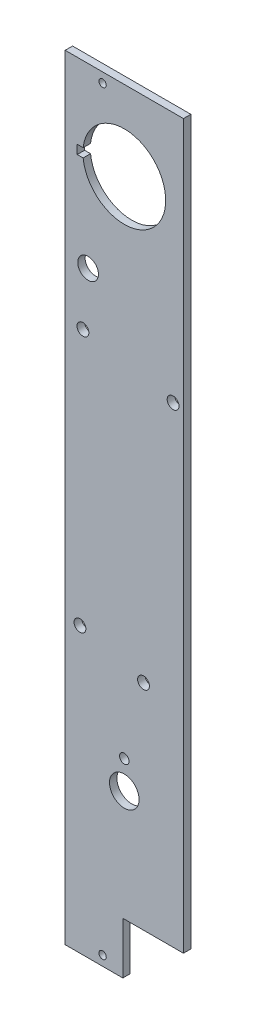
ISO-10303-21;
HEADER;
FILE_DESCRIPTION(('STEP AP214'),'2;1');
FILE_NAME('part.step','',(''),(''),'','','');
FILE_SCHEMA(('AUTOMOTIVE_DESIGN { 1 0 10303 214 1 1 1 1 }'));
ENDSEC;
DATA;
#1=APPLICATION_CONTEXT('core data for automotive mechanical design processes');
#2=APPLICATION_PROTOCOL_DEFINITION('international standard','automotive_design',2000,#1);
#3=PRODUCT_CONTEXT('',#1,'mechanical');
#4=PRODUCT('Part','Part','',(#3));
#5=PRODUCT_RELATED_PRODUCT_CATEGORY('part','',(#4));
#6=PRODUCT_DEFINITION_FORMATION('','',#4);
#7=PRODUCT_DEFINITION_CONTEXT('part definition',#1,'design');
#8=PRODUCT_DEFINITION('design','',#6,#7);
#9=PRODUCT_DEFINITION_SHAPE('','',#8);
#10=(LENGTH_UNIT() NAMED_UNIT(*) SI_UNIT(.MILLI.,.METRE.));
#11=(NAMED_UNIT(*) PLANE_ANGLE_UNIT() SI_UNIT($,.RADIAN.));
#12=(NAMED_UNIT(*) SI_UNIT($,.STERADIAN.) SOLID_ANGLE_UNIT());
#13=UNCERTAINTY_MEASURE_WITH_UNIT(LENGTH_MEASURE(1.E-05),#10,'distance_accuracy_value','');
#14=(GEOMETRIC_REPRESENTATION_CONTEXT(3) GLOBAL_UNCERTAINTY_ASSIGNED_CONTEXT((#13)) GLOBAL_UNIT_ASSIGNED_CONTEXT((#10,
#11,#12)) REPRESENTATION_CONTEXT('',''));
#15=CARTESIAN_POINT('',(0.,0.,0.));
#16=DIRECTION('',(0.,0.,1.));
#17=DIRECTION('',(1.,0.,0.));
#18=AXIS2_PLACEMENT_3D('',#15,#16,#17);
#19=CARTESIAN_POINT('',(0.,0.,2.5));
#20=DIRECTION('',(0.,0.,-1.));
#21=DIRECTION('',(-1.,0.,0.));
#22=AXIS2_PLACEMENT_3D('',#19,#20,#21);
#23=PLANE('',#22);
#24=CARTESIAN_POINT('',(7.75,202.,2.5));
#25=DIRECTION('',(0.,0.,1.));
#26=DIRECTION('',(1.,0.,0.));
#27=AXIS2_PLACEMENT_3D('',#24,#25,#26);
#28=CIRCLE('',#27,3.5);
#29=CARTESIAN_POINT('',(11.25,202.,2.5));
#30=VERTEX_POINT('',#29);
#31=EDGE_CURVE('E135',#30,#30,#28,.T.);
#32=ORIENTED_EDGE('',*,*,#31,.F.);
#33=EDGE_LOOP('',(#32));
#34=FACE_BOUND('',#33,.T.);
#35=CARTESIAN_POINT('',(6.,183.25,2.5));
#36=DIRECTION('',(0.,0.,1.));
#37=DIRECTION('',(1.,0.,0.));
#38=AXIS2_PLACEMENT_3D('',#35,#36,#37);
#39=CIRCLE('',#38,2.);
#40=CARTESIAN_POINT('',(8.,183.25,2.5));
#41=VERTEX_POINT('',#40);
#42=EDGE_CURVE('E141',#41,#41,#39,.T.);
#43=ORIENTED_EDGE('',*,*,#42,.F.);
#44=EDGE_LOOP('',(#43));
#45=FACE_BOUND('',#44,.T.);
#46=CARTESIAN_POINT('',(36.5,177.,2.5));
#47=DIRECTION('',(0.,0.,1.));
#48=DIRECTION('',(1.,0.,0.));
#49=AXIS2_PLACEMENT_3D('',#46,#47,#48);
#50=CIRCLE('',#49,2.);
#51=CARTESIAN_POINT('',(38.5,177.,2.5));
#52=VERTEX_POINT('',#51);
#53=EDGE_CURVE('E147',#52,#52,#50,.T.);
#54=ORIENTED_EDGE('',*,*,#53,.F.);
#55=EDGE_LOOP('',(#54));
#56=FACE_BOUND('',#55,.T.);
#57=CARTESIAN_POINT('',(26.5,90.,2.5));
#58=DIRECTION('',(0.,0.,1.));
#59=DIRECTION('',(1.,0.,0.));
#60=AXIS2_PLACEMENT_3D('',#57,#58,#59);
#61=CIRCLE('',#60,2.00000000000001);
#62=CARTESIAN_POINT('',(28.5,90.,2.5));
#63=VERTEX_POINT('',#62);
#64=EDGE_CURVE('E153',#63,#63,#61,.T.);
#65=ORIENTED_EDGE('',*,*,#64,.F.);
#66=EDGE_LOOP('',(#65));
#67=FACE_BOUND('',#66,.T.);
#68=CARTESIAN_POINT('',(5.,96.,2.5));
#69=DIRECTION('',(0.,0.,1.));
#70=DIRECTION('',(1.,0.,0.));
#71=AXIS2_PLACEMENT_3D('',#68,#69,#70);
#72=CIRCLE('',#71,2.);
#73=CARTESIAN_POINT('',(7.,96.,2.5));
#74=VERTEX_POINT('',#73);
#75=EDGE_CURVE('E159',#74,#74,#72,.T.);
#76=ORIENTED_EDGE('',*,*,#75,.F.);
#77=EDGE_LOOP('',(#76));
#78=FACE_BOUND('',#77,.T.);
#79=CARTESIAN_POINT('',(20.,64.5047736751736,2.5));
#80=DIRECTION('',(0.,0.,1.));
#81=DIRECTION('',(1.,0.,0.));
#82=AXIS2_PLACEMENT_3D('',#79,#80,#81);
#83=CIRCLE('',#82,1.6);
#84=CARTESIAN_POINT('',(21.6,64.5047736751736,2.5));
#85=VERTEX_POINT('',#84);
#86=EDGE_CURVE('E165',#85,#85,#83,.T.);
#87=ORIENTED_EDGE('',*,*,#86,.F.);
#88=EDGE_LOOP('',(#87));
#89=FACE_BOUND('',#88,.T.);
#90=DIRECTION('',(-1.,0.,0.));
#91=VECTOR('',#90,1.);
#92=CARTESIAN_POINT('',(4.08058908868214,236.497785389585,2.5));
#93=LINE('',#92,#91);
#94=CARTESIAN_POINT('',(6.08058909292492,236.497785389585,2.5));
#95=VERTEX_POINT('',#94);
#96=CARTESIAN_POINT('',(4.08058908868214,236.497785389585,2.5));
#97=VERTEX_POINT('',#96);
#98=EDGE_CURVE('E188',#95,#97,#93,.T.);
#99=ORIENTED_EDGE('',*,*,#98,.F.);
#100=CARTESIAN_POINT('',(20.,234.997785389585,2.5));
#101=DIRECTION('',(0.,0.,1.));
#102=DIRECTION('',(1.,0.,0.));
#103=AXIS2_PLACEMENT_3D('',#100,#101,#102);
#104=CIRCLE('',#103,14.);
#105=CARTESIAN_POINT('',(6.08058909292494,233.497785389585,2.5));
#106=VERTEX_POINT('',#105);
#107=EDGE_CURVE('E56',#106,#95,#104,.T.);
#108=ORIENTED_EDGE('',*,*,#107,.F.);
#109=DIRECTION('',(1.,0.,0.));
#110=VECTOR('',#109,1.);
#111=CARTESIAN_POINT('',(6.08058909292494,233.497785389585,2.5));
#112=LINE('',#111,#110);
#113=CARTESIAN_POINT('',(4.08058908868214,233.497785389585,2.5));
#114=VERTEX_POINT('',#113);
#115=EDGE_CURVE('E177',#114,#106,#112,.T.);
#116=ORIENTED_EDGE('',*,*,#115,.F.);
#117=DIRECTION('',(0.,-1.,0.));
#118=VECTOR('',#117,1.);
#119=CARTESIAN_POINT('',(4.08058908868214,233.497785389585,2.5));
#120=LINE('',#119,#118);
#121=EDGE_CURVE('E191',#97,#114,#120,.T.);
#122=ORIENTED_EDGE('',*,*,#121,.F.);
#123=EDGE_LOOP('',(#99,#108,#116,#122));
#124=FACE_BOUND('',#123,.T.);
#125=CARTESIAN_POINT('',(20.,55.0047736751736,2.5));
#126=DIRECTION('',(0.,0.,1.));
#127=DIRECTION('',(1.,0.,0.));
#128=AXIS2_PLACEMENT_3D('',#125,#126,#127);
#129=CIRCLE('',#128,5.);
#130=CARTESIAN_POINT('',(25.,55.0047736751736,2.5));
#131=VERTEX_POINT('',#130);
#132=EDGE_CURVE('E198',#131,#131,#129,.T.);
#133=ORIENTED_EDGE('',*,*,#132,.F.);
#134=EDGE_LOOP('',(#133));
#135=FACE_BOUND('',#134,.T.);
#136=CARTESIAN_POINT('',(12.65,258.7,2.5));
#137=DIRECTION('',(0.,0.,1.));
#138=DIRECTION('',(1.,0.,0.));
#139=AXIS2_PLACEMENT_3D('',#136,#137,#138);
#140=CIRCLE('',#139,1.25);
#141=CARTESIAN_POINT('',(13.9,258.7,2.5));
#142=VERTEX_POINT('',#141);
#143=EDGE_CURVE('E216',#142,#142,#140,.T.);
#144=ORIENTED_EDGE('',*,*,#143,.F.);
#145=EDGE_LOOP('',(#144));
#146=FACE_BOUND('',#145,.T.);
#147=DIRECTION('',(1.,0.,0.));
#148=VECTOR('',#147,1.);
#149=CARTESIAN_POINT('',(0.,0.,2.5));
#150=LINE('',#149,#148);
#151=CARTESIAN_POINT('',(0.,0.,2.5));
#152=VERTEX_POINT('',#151);
#153=CARTESIAN_POINT('',(19.5,0.,2.5));
#154=VERTEX_POINT('',#153);
#155=EDGE_CURVE('E225',#152,#154,#150,.T.);
#156=ORIENTED_EDGE('',*,*,#155,.T.);
#157=DIRECTION('',(0.,-1.,0.));
#158=VECTOR('',#157,1.);
#159=CARTESIAN_POINT('',(19.5,0.,2.5));
#160=LINE('',#159,#158);
#161=CARTESIAN_POINT('',(19.5,17.5,2.5));
#162=VERTEX_POINT('',#161);
#163=EDGE_CURVE('E130',#162,#154,#160,.T.);
#164=ORIENTED_EDGE('',*,*,#163,.F.);
#165=DIRECTION('',(-1.,0.,0.));
#166=VECTOR('',#165,1.);
#167=CARTESIAN_POINT('',(40.,17.5,2.5));
#168=LINE('',#167,#166);
#169=CARTESIAN_POINT('',(40.,17.5,2.5));
#170=VERTEX_POINT('',#169);
#171=EDGE_CURVE('E112',#170,#162,#168,.T.);
#172=ORIENTED_EDGE('',*,*,#171,.F.);
#173=DIRECTION('',(0.,1.,0.));
#174=VECTOR('',#173,1.);
#175=CARTESIAN_POINT('',(40.,0.,2.5));
#176=LINE('',#175,#174);
#177=CARTESIAN_POINT('',(40.,262.,2.5));
#178=VERTEX_POINT('',#177);
#179=EDGE_CURVE('E229',#170,#178,#176,.T.);
#180=ORIENTED_EDGE('',*,*,#179,.T.);
#181=DIRECTION('',(-1.,0.,0.));
#182=VECTOR('',#181,1.);
#183=CARTESIAN_POINT('',(0.,262.,2.5));
#184=LINE('',#183,#182);
#185=CARTESIAN_POINT('',(0.,262.,2.5));
#186=VERTEX_POINT('',#185);
#187=EDGE_CURVE('E231',#178,#186,#184,.T.);
#188=ORIENTED_EDGE('',*,*,#187,.T.);
#189=DIRECTION('',(0.,-1.,0.));
#190=VECTOR('',#189,1.);
#191=CARTESIAN_POINT('',(0.,0.,2.5));
#192=LINE('',#191,#190);
#193=EDGE_CURVE('E222',#186,#152,#192,.T.);
#194=ORIENTED_EDGE('',*,*,#193,.T.);
#195=EDGE_LOOP('',(#156,#164,#172,#180,#188,#194));
#196=FACE_BOUND('',#195,.T.);
#197=CARTESIAN_POINT('',(12.65,3.3,2.5));
#198=DIRECTION('',(0.,0.,1.));
#199=DIRECTION('',(1.,0.,0.));
#200=AXIS2_PLACEMENT_3D('',#197,#198,#199);
#201=CIRCLE('',#200,1.25);
#202=CARTESIAN_POINT('',(13.9,3.3,2.5));
#203=VERTEX_POINT('',#202);
#204=EDGE_CURVE('E210',#203,#203,#201,.T.);
#205=ORIENTED_EDGE('',*,*,#204,.F.);
#206=EDGE_LOOP('',(#205));
#207=FACE_BOUND('',#206,.T.);
#208=ADVANCED_FACE('F33',(#34,#45,#56,#67,#78,#89,#124,#135,#146,#196,#207),#23,.F.);
#209=CARTESIAN_POINT('',(0.,0.,0.));
#210=DIRECTION('',(0.,0.,-1.));
#211=DIRECTION('',(-1.,0.,0.));
#212=AXIS2_PLACEMENT_3D('',#209,#210,#211);
#213=PLANE('',#212);
#214=DIRECTION('',(0.,-1.,0.));
#215=VECTOR('',#214,1.);
#216=CARTESIAN_POINT('',(19.5,0.,0.));
#217=LINE('',#216,#215);
#218=CARTESIAN_POINT('',(19.5,17.5,0.));
#219=VERTEX_POINT('',#218);
#220=CARTESIAN_POINT('',(19.5,0.,0.));
#221=VERTEX_POINT('',#220);
#222=EDGE_CURVE('E119',#219,#221,#217,.T.);
#223=ORIENTED_EDGE('',*,*,#222,.T.);
#224=DIRECTION('',(1.,0.,0.));
#225=VECTOR('',#224,1.);
#226=CARTESIAN_POINT('',(0.,0.,0.));
#227=LINE('',#226,#225);
#228=CARTESIAN_POINT('',(0.,0.,0.));
#229=VERTEX_POINT('',#228);
#230=EDGE_CURVE('E236',#229,#221,#227,.T.);
#231=ORIENTED_EDGE('',*,*,#230,.F.);
#232=DIRECTION('',(0.,-1.,0.));
#233=VECTOR('',#232,1.);
#234=CARTESIAN_POINT('',(0.,0.,0.));
#235=LINE('',#234,#233);
#236=CARTESIAN_POINT('',(0.,262.,0.));
#237=VERTEX_POINT('',#236);
#238=EDGE_CURVE('E219',#237,#229,#235,.T.);
#239=ORIENTED_EDGE('',*,*,#238,.F.);
#240=DIRECTION('',(-1.,0.,0.));
#241=VECTOR('',#240,1.);
#242=CARTESIAN_POINT('',(0.,262.,0.));
#243=LINE('',#242,#241);
#244=CARTESIAN_POINT('',(40.,262.,0.));
#245=VERTEX_POINT('',#244);
#246=EDGE_CURVE('E226',#245,#237,#243,.T.);
#247=ORIENTED_EDGE('',*,*,#246,.F.);
#248=DIRECTION('',(0.,1.,0.));
#249=VECTOR('',#248,1.);
#250=CARTESIAN_POINT('',(40.,0.,0.));
#251=LINE('',#250,#249);
#252=CARTESIAN_POINT('',(40.,17.5,0.));
#253=VERTEX_POINT('',#252);
#254=EDGE_CURVE('E129',#253,#245,#251,.T.);
#255=ORIENTED_EDGE('',*,*,#254,.F.);
#256=DIRECTION('',(-1.,0.,0.));
#257=VECTOR('',#256,1.);
#258=CARTESIAN_POINT('',(40.,17.5,0.));
#259=LINE('',#258,#257);
#260=EDGE_CURVE('E48',#253,#219,#259,.T.);
#261=ORIENTED_EDGE('',*,*,#260,.T.);
#262=EDGE_LOOP('',(#223,#231,#239,#247,#255,#261));
#263=FACE_BOUND('',#262,.T.);
#264=CARTESIAN_POINT('',(7.75,202.,0.));
#265=DIRECTION('',(0.,0.,1.));
#266=DIRECTION('',(1.,0.,0.));
#267=AXIS2_PLACEMENT_3D('',#264,#265,#266);
#268=CIRCLE('',#267,3.5);
#269=CARTESIAN_POINT('',(11.25,202.,0.));
#270=VERTEX_POINT('',#269);
#271=EDGE_CURVE('E138',#270,#270,#268,.T.);
#272=ORIENTED_EDGE('',*,*,#271,.T.);
#273=EDGE_LOOP('',(#272));
#274=FACE_BOUND('',#273,.T.);
#275=CARTESIAN_POINT('',(6.,183.25,0.));
#276=DIRECTION('',(0.,0.,1.));
#277=DIRECTION('',(1.,0.,0.));
#278=AXIS2_PLACEMENT_3D('',#275,#276,#277);
#279=CIRCLE('',#278,2.);
#280=CARTESIAN_POINT('',(8.,183.25,0.));
#281=VERTEX_POINT('',#280);
#282=EDGE_CURVE('E144',#281,#281,#279,.T.);
#283=ORIENTED_EDGE('',*,*,#282,.T.);
#284=EDGE_LOOP('',(#283));
#285=FACE_BOUND('',#284,.T.);
#286=CARTESIAN_POINT('',(36.5,177.,0.));
#287=DIRECTION('',(0.,0.,1.));
#288=DIRECTION('',(1.,0.,0.));
#289=AXIS2_PLACEMENT_3D('',#286,#287,#288);
#290=CIRCLE('',#289,2.);
#291=CARTESIAN_POINT('',(38.5,177.,0.));
#292=VERTEX_POINT('',#291);
#293=EDGE_CURVE('E150',#292,#292,#290,.T.);
#294=ORIENTED_EDGE('',*,*,#293,.T.);
#295=EDGE_LOOP('',(#294));
#296=FACE_BOUND('',#295,.T.);
#297=CARTESIAN_POINT('',(26.5,90.,0.));
#298=DIRECTION('',(0.,0.,1.));
#299=DIRECTION('',(1.,0.,0.));
#300=AXIS2_PLACEMENT_3D('',#297,#298,#299);
#301=CIRCLE('',#300,2.00000000000001);
#302=CARTESIAN_POINT('',(28.5,90.,0.));
#303=VERTEX_POINT('',#302);
#304=EDGE_CURVE('E156',#303,#303,#301,.T.);
#305=ORIENTED_EDGE('',*,*,#304,.T.);
#306=EDGE_LOOP('',(#305));
#307=FACE_BOUND('',#306,.T.);
#308=CARTESIAN_POINT('',(5.,96.,0.));
#309=DIRECTION('',(0.,0.,1.));
#310=DIRECTION('',(1.,0.,0.));
#311=AXIS2_PLACEMENT_3D('',#308,#309,#310);
#312=CIRCLE('',#311,2.);
#313=CARTESIAN_POINT('',(7.,96.,0.));
#314=VERTEX_POINT('',#313);
#315=EDGE_CURVE('E162',#314,#314,#312,.T.);
#316=ORIENTED_EDGE('',*,*,#315,.T.);
#317=EDGE_LOOP('',(#316));
#318=FACE_BOUND('',#317,.T.);
#319=CARTESIAN_POINT('',(20.,64.5047736751736,0.));
#320=DIRECTION('',(0.,0.,1.));
#321=DIRECTION('',(1.,0.,0.));
#322=AXIS2_PLACEMENT_3D('',#319,#320,#321);
#323=CIRCLE('',#322,1.6);
#324=CARTESIAN_POINT('',(21.6,64.5047736751736,0.));
#325=VERTEX_POINT('',#324);
#326=EDGE_CURVE('E168',#325,#325,#323,.T.);
#327=ORIENTED_EDGE('',*,*,#326,.T.);
#328=EDGE_LOOP('',(#327));
#329=FACE_BOUND('',#328,.T.);
#330=CARTESIAN_POINT('',(20.,234.997785389585,0.));
#331=DIRECTION('',(0.,0.,1.));
#332=DIRECTION('',(1.,0.,0.));
#333=AXIS2_PLACEMENT_3D('',#330,#331,#332);
#334=CIRCLE('',#333,14.);
#335=CARTESIAN_POINT('',(6.08058909292494,233.497785389585,0.));
#336=VERTEX_POINT('',#335);
#337=CARTESIAN_POINT('',(6.08058909292492,236.497785389585,0.));
#338=VERTEX_POINT('',#337);
#339=EDGE_CURVE('E173',#336,#338,#334,.T.);
#340=ORIENTED_EDGE('',*,*,#339,.T.);
#341=DIRECTION('',(-1.,0.,0.));
#342=VECTOR('',#341,1.);
#343=CARTESIAN_POINT('',(4.08058908868214,236.497785389585,0.));
#344=LINE('',#343,#342);
#345=CARTESIAN_POINT('',(4.08058908868214,236.497785389585,0.));
#346=VERTEX_POINT('',#345);
#347=EDGE_CURVE('E176',#338,#346,#344,.T.);
#348=ORIENTED_EDGE('',*,*,#347,.T.);
#349=DIRECTION('',(0.,-1.,0.));
#350=VECTOR('',#349,1.);
#351=CARTESIAN_POINT('',(4.08058908868214,233.497785389585,0.));
#352=LINE('',#351,#350);
#353=CARTESIAN_POINT('',(4.08058908868214,233.497785389585,0.));
#354=VERTEX_POINT('',#353);
#355=EDGE_CURVE('E180',#346,#354,#352,.T.);
#356=ORIENTED_EDGE('',*,*,#355,.T.);
#357=DIRECTION('',(1.,0.,0.));
#358=VECTOR('',#357,1.);
#359=CARTESIAN_POINT('',(6.08058909292494,233.497785389585,0.));
#360=LINE('',#359,#358);
#361=EDGE_CURVE('E183',#354,#336,#360,.T.);
#362=ORIENTED_EDGE('',*,*,#361,.T.);
#363=EDGE_LOOP('',(#340,#348,#356,#362));
#364=FACE_BOUND('',#363,.T.);
#365=CARTESIAN_POINT('',(20.,55.0047736751736,0.));
#366=DIRECTION('',(0.,0.,1.));
#367=DIRECTION('',(1.,0.,0.));
#368=AXIS2_PLACEMENT_3D('',#365,#366,#367);
#369=CIRCLE('',#368,5.);
#370=CARTESIAN_POINT('',(25.,55.0047736751736,0.));
#371=VERTEX_POINT('',#370);
#372=EDGE_CURVE('E204',#371,#371,#369,.T.);
#373=ORIENTED_EDGE('',*,*,#372,.T.);
#374=EDGE_LOOP('',(#373));
#375=FACE_BOUND('',#374,.T.);
#376=CARTESIAN_POINT('',(12.65,258.7,0.));
#377=DIRECTION('',(0.,0.,1.));
#378=DIRECTION('',(1.,0.,0.));
#379=AXIS2_PLACEMENT_3D('',#376,#377,#378);
#380=CIRCLE('',#379,1.25);
#381=CARTESIAN_POINT('',(13.9,258.7,0.));
#382=VERTEX_POINT('',#381);
#383=EDGE_CURVE('E213',#382,#382,#380,.T.);
#384=ORIENTED_EDGE('',*,*,#383,.T.);
#385=EDGE_LOOP('',(#384));
#386=FACE_BOUND('',#385,.T.);
#387=CARTESIAN_POINT('',(12.65,3.3,0.));
#388=DIRECTION('',(0.,0.,1.));
#389=DIRECTION('',(1.,0.,0.));
#390=AXIS2_PLACEMENT_3D('',#387,#388,#389);
#391=CIRCLE('',#390,1.25);
#392=CARTESIAN_POINT('',(13.9,3.3,0.));
#393=VERTEX_POINT('',#392);
#394=EDGE_CURVE('E207',#393,#393,#391,.T.);
#395=ORIENTED_EDGE('',*,*,#394,.T.);
#396=EDGE_LOOP('',(#395));
#397=FACE_BOUND('',#396,.T.);
#398=ADVANCED_FACE('F126',(#263,#274,#285,#296,#307,#318,#329,#364,#375,#386,#397),#213,.T.);
#399=CARTESIAN_POINT('',(0.,0.,2.5));
#400=DIRECTION('',(1.,0.,0.));
#401=DIRECTION('',(0.,0.,-1.));
#402=AXIS2_PLACEMENT_3D('',#399,#400,#401);
#403=PLANE('',#402);
#404=ORIENTED_EDGE('',*,*,#238,.T.);
#405=DIRECTION('',(0.,0.,-1.));
#406=VECTOR('',#405,1.);
#407=CARTESIAN_POINT('',(0.,0.,2.5));
#408=LINE('',#407,#406);
#409=EDGE_CURVE('E11',#152,#229,#408,.T.);
#410=ORIENTED_EDGE('',*,*,#409,.F.);
#411=ORIENTED_EDGE('',*,*,#193,.F.);
#412=DIRECTION('',(0.,0.,-1.));
#413=VECTOR('',#412,1.);
#414=CARTESIAN_POINT('',(0.,262.,2.5));
#415=LINE('',#414,#413);
#416=EDGE_CURVE('E233',#186,#237,#415,.T.);
#417=ORIENTED_EDGE('',*,*,#416,.T.);
#418=EDGE_LOOP('',(#404,#410,#411,#417));
#419=FACE_BOUND('',#418,.T.);
#420=ADVANCED_FACE('F35',(#419),#403,.F.);
#421=CARTESIAN_POINT('',(0.,0.,2.5));
#422=DIRECTION('',(0.,1.,0.));
#423=DIRECTION('',(0.,0.,1.));
#424=AXIS2_PLACEMENT_3D('',#421,#422,#423);
#425=PLANE('',#424);
#426=ORIENTED_EDGE('',*,*,#230,.T.);
#427=DIRECTION('',(0.,0.,1.));
#428=VECTOR('',#427,1.);
#429=CARTESIAN_POINT('',(19.5,0.,0.));
#430=LINE('',#429,#428);
#431=EDGE_CURVE('E115',#221,#154,#430,.T.);
#432=ORIENTED_EDGE('',*,*,#431,.T.);
#433=ORIENTED_EDGE('',*,*,#155,.F.);
#434=ORIENTED_EDGE('',*,*,#409,.T.);
#435=EDGE_LOOP('',(#426,#432,#433,#434));
#436=FACE_BOUND('',#435,.T.);
#437=ADVANCED_FACE('F257',(#436),#425,.F.);
#438=CARTESIAN_POINT('',(40.,0.,2.5));
#439=DIRECTION('',(-1.,0.,0.));
#440=DIRECTION('',(0.,0.,1.));
#441=AXIS2_PLACEMENT_3D('',#438,#439,#440);
#442=PLANE('',#441);
#443=ORIENTED_EDGE('',*,*,#179,.F.);
#444=DIRECTION('',(0.,0.,1.));
#445=VECTOR('',#444,1.);
#446=CARTESIAN_POINT('',(40.,17.5,0.));
#447=LINE('',#446,#445);
#448=EDGE_CURVE('E116',#253,#170,#447,.T.);
#449=ORIENTED_EDGE('',*,*,#448,.F.);
#450=ORIENTED_EDGE('',*,*,#254,.T.);
#451=DIRECTION('',(0.,0.,-1.));
#452=VECTOR('',#451,1.);
#453=CARTESIAN_POINT('',(40.,262.,2.5));
#454=LINE('',#453,#452);
#455=EDGE_CURVE('E41',#178,#245,#454,.T.);
#456=ORIENTED_EDGE('',*,*,#455,.F.);
#457=EDGE_LOOP('',(#443,#449,#450,#456));
#458=FACE_BOUND('',#457,.T.);
#459=ADVANCED_FACE('F255',(#458),#442,.F.);
#460=CARTESIAN_POINT('',(0.,262.,2.5));
#461=DIRECTION('',(0.,-1.,0.));
#462=DIRECTION('',(0.,0.,-1.));
#463=AXIS2_PLACEMENT_3D('',#460,#461,#462);
#464=PLANE('',#463);
#465=ORIENTED_EDGE('',*,*,#246,.T.);
#466=ORIENTED_EDGE('',*,*,#416,.F.);
#467=ORIENTED_EDGE('',*,*,#187,.F.);
#468=ORIENTED_EDGE('',*,*,#455,.T.);
#469=EDGE_LOOP('',(#465,#466,#467,#468));
#470=FACE_BOUND('',#469,.T.);
#471=ADVANCED_FACE('F245',(#470),#464,.F.);
#472=CARTESIAN_POINT('',(12.65,258.7,2.5));
#473=DIRECTION('',(0.,0.,-1.));
#474=DIRECTION('',(-1.,0.,0.));
#475=AXIS2_PLACEMENT_3D('',#472,#473,#474);
#476=CYLINDRICAL_SURFACE('',#475,1.25);
#477=ORIENTED_EDGE('',*,*,#143,.T.);
#478=EDGE_LOOP('',(#477));
#479=FACE_BOUND('',#478,.T.);
#480=ORIENTED_EDGE('',*,*,#383,.F.);
#481=EDGE_LOOP('',(#480));
#482=FACE_BOUND('',#481,.T.);
#483=ADVANCED_FACE('F264',(#479,#482),#476,.F.);
#484=CARTESIAN_POINT('',(12.65,3.3,2.5));
#485=DIRECTION('',(0.,0.,-1.));
#486=DIRECTION('',(-1.,0.,0.));
#487=AXIS2_PLACEMENT_3D('',#484,#485,#486);
#488=CYLINDRICAL_SURFACE('',#487,1.25);
#489=ORIENTED_EDGE('',*,*,#204,.T.);
#490=EDGE_LOOP('',(#489));
#491=FACE_BOUND('',#490,.T.);
#492=ORIENTED_EDGE('',*,*,#394,.F.);
#493=EDGE_LOOP('',(#492));
#494=FACE_BOUND('',#493,.T.);
#495=ADVANCED_FACE('F280',(#491,#494),#488,.F.);
#496=CARTESIAN_POINT('',(20.,55.0047736751736,0.));
#497=DIRECTION('',(0.,0.,1.));
#498=DIRECTION('',(1.,0.,0.));
#499=AXIS2_PLACEMENT_3D('',#496,#497,#498);
#500=CYLINDRICAL_SURFACE('',#499,5.);
#501=ORIENTED_EDGE('',*,*,#372,.F.);
#502=EDGE_LOOP('',(#501));
#503=FACE_BOUND('',#502,.T.);
#504=ORIENTED_EDGE('',*,*,#132,.T.);
#505=EDGE_LOOP('',(#504));
#506=FACE_BOUND('',#505,.T.);
#507=ADVANCED_FACE('F284',(#503,#506),#500,.F.);
#508=CARTESIAN_POINT('',(20.,234.997785389585,0.));
#509=DIRECTION('',(0.,0.,1.));
#510=DIRECTION('',(1.,0.,0.));
#511=AXIS2_PLACEMENT_3D('',#508,#509,#510);
#512=CYLINDRICAL_SURFACE('',#511,14.);
#513=ORIENTED_EDGE('',*,*,#107,.T.);
#514=DIRECTION('',(0.,0.,1.));
#515=VECTOR('',#514,1.);
#516=CARTESIAN_POINT('',(6.08058909292492,236.497785389585,0.));
#517=LINE('',#516,#515);
#518=EDGE_CURVE('E186',#338,#95,#517,.T.);
#519=ORIENTED_EDGE('',*,*,#518,.F.);
#520=ORIENTED_EDGE('',*,*,#339,.F.);
#521=DIRECTION('',(0.,0.,1.));
#522=VECTOR('',#521,1.);
#523=CARTESIAN_POINT('',(6.08058909292494,233.497785389585,0.));
#524=LINE('',#523,#522);
#525=EDGE_CURVE('E196',#336,#106,#524,.T.);
#526=ORIENTED_EDGE('',*,*,#525,.T.);
#527=EDGE_LOOP('',(#513,#519,#520,#526));
#528=FACE_BOUND('',#527,.T.);
#529=ADVANCED_FACE('F288',(#528),#512,.F.);
#530=CARTESIAN_POINT('',(6.08058909292494,233.497785389585,0.));
#531=DIRECTION('',(0.,-1.,0.));
#532=DIRECTION('',(0.,0.,-1.));
#533=AXIS2_PLACEMENT_3D('',#530,#531,#532);
#534=PLANE('',#533);
#535=ORIENTED_EDGE('',*,*,#115,.T.);
#536=ORIENTED_EDGE('',*,*,#525,.F.);
#537=ORIENTED_EDGE('',*,*,#361,.F.);
#538=DIRECTION('',(0.,0.,1.));
#539=VECTOR('',#538,1.);
#540=CARTESIAN_POINT('',(4.08058908868214,233.497785389585,0.));
#541=LINE('',#540,#539);
#542=EDGE_CURVE('E199',#354,#114,#541,.T.);
#543=ORIENTED_EDGE('',*,*,#542,.T.);
#544=EDGE_LOOP('',(#535,#536,#537,#543));
#545=FACE_BOUND('',#544,.T.);
#546=ADVANCED_FACE('F292',(#545),#534,.F.);
#547=CARTESIAN_POINT('',(4.08058908868214,233.497785389585,0.));
#548=DIRECTION('',(-1.,0.,0.));
#549=DIRECTION('',(0.,0.,1.));
#550=AXIS2_PLACEMENT_3D('',#547,#548,#549);
#551=PLANE('',#550);
#552=ORIENTED_EDGE('',*,*,#121,.T.);
#553=ORIENTED_EDGE('',*,*,#542,.F.);
#554=ORIENTED_EDGE('',*,*,#355,.F.);
#555=DIRECTION('',(0.,0.,1.));
#556=VECTOR('',#555,1.);
#557=CARTESIAN_POINT('',(4.08058908868214,236.497785389585,0.));
#558=LINE('',#557,#556);
#559=EDGE_CURVE('E201',#346,#97,#558,.T.);
#560=ORIENTED_EDGE('',*,*,#559,.T.);
#561=EDGE_LOOP('',(#552,#553,#554,#560));
#562=FACE_BOUND('',#561,.T.);
#563=ADVANCED_FACE('F297',(#562),#551,.F.);
#564=CARTESIAN_POINT('',(4.08058908868214,236.497785389585,0.));
#565=DIRECTION('',(0.,1.,0.));
#566=DIRECTION('',(0.,0.,1.));
#567=AXIS2_PLACEMENT_3D('',#564,#565,#566);
#568=PLANE('',#567);
#569=ORIENTED_EDGE('',*,*,#98,.T.);
#570=ORIENTED_EDGE('',*,*,#559,.F.);
#571=ORIENTED_EDGE('',*,*,#347,.F.);
#572=ORIENTED_EDGE('',*,*,#518,.T.);
#573=EDGE_LOOP('',(#569,#570,#571,#572));
#574=FACE_BOUND('',#573,.T.);
#575=ADVANCED_FACE('F293',(#574),#568,.F.);
#576=CARTESIAN_POINT('',(20.,64.5047736751736,0.));
#577=DIRECTION('',(0.,0.,1.));
#578=DIRECTION('',(1.,0.,0.));
#579=AXIS2_PLACEMENT_3D('',#576,#577,#578);
#580=CYLINDRICAL_SURFACE('',#579,1.6);
#581=ORIENTED_EDGE('',*,*,#326,.F.);
#582=EDGE_LOOP('',(#581));
#583=FACE_BOUND('',#582,.T.);
#584=ORIENTED_EDGE('',*,*,#86,.T.);
#585=EDGE_LOOP('',(#584));
#586=FACE_BOUND('',#585,.T.);
#587=ADVANCED_FACE('F296',(#583,#586),#580,.F.);
#588=CARTESIAN_POINT('',(5.,96.,0.));
#589=DIRECTION('',(0.,0.,1.));
#590=DIRECTION('',(1.,0.,0.));
#591=AXIS2_PLACEMENT_3D('',#588,#589,#590);
#592=CYLINDRICAL_SURFACE('',#591,2.);
#593=ORIENTED_EDGE('',*,*,#315,.F.);
#594=EDGE_LOOP('',(#593));
#595=FACE_BOUND('',#594,.T.);
#596=ORIENTED_EDGE('',*,*,#75,.T.);
#597=EDGE_LOOP('',(#596));
#598=FACE_BOUND('',#597,.T.);
#599=ADVANCED_FACE('F307',(#595,#598),#592,.F.);
#600=CARTESIAN_POINT('',(26.5,90.,0.));
#601=DIRECTION('',(0.,0.,1.));
#602=DIRECTION('',(1.,0.,0.));
#603=AXIS2_PLACEMENT_3D('',#600,#601,#602);
#604=CYLINDRICAL_SURFACE('',#603,2.00000000000001);
#605=ORIENTED_EDGE('',*,*,#304,.F.);
#606=EDGE_LOOP('',(#605));
#607=FACE_BOUND('',#606,.T.);
#608=ORIENTED_EDGE('',*,*,#64,.T.);
#609=EDGE_LOOP('',(#608));
#610=FACE_BOUND('',#609,.T.);
#611=ADVANCED_FACE('F311',(#607,#610),#604,.F.);
#612=CARTESIAN_POINT('',(36.5,177.,0.));
#613=DIRECTION('',(0.,0.,1.));
#614=DIRECTION('',(1.,0.,0.));
#615=AXIS2_PLACEMENT_3D('',#612,#613,#614);
#616=CYLINDRICAL_SURFACE('',#615,2.);
#617=ORIENTED_EDGE('',*,*,#293,.F.);
#618=EDGE_LOOP('',(#617));
#619=FACE_BOUND('',#618,.T.);
#620=ORIENTED_EDGE('',*,*,#53,.T.);
#621=EDGE_LOOP('',(#620));
#622=FACE_BOUND('',#621,.T.);
#623=ADVANCED_FACE('F315',(#619,#622),#616,.F.);
#624=CARTESIAN_POINT('',(6.,183.25,0.));
#625=DIRECTION('',(0.,0.,1.));
#626=DIRECTION('',(1.,0.,0.));
#627=AXIS2_PLACEMENT_3D('',#624,#625,#626);
#628=CYLINDRICAL_SURFACE('',#627,2.);
#629=ORIENTED_EDGE('',*,*,#282,.F.);
#630=EDGE_LOOP('',(#629));
#631=FACE_BOUND('',#630,.T.);
#632=ORIENTED_EDGE('',*,*,#42,.T.);
#633=EDGE_LOOP('',(#632));
#634=FACE_BOUND('',#633,.T.);
#635=ADVANCED_FACE('F319',(#631,#634),#628,.F.);
#636=CARTESIAN_POINT('',(7.75,202.,0.));
#637=DIRECTION('',(0.,0.,1.));
#638=DIRECTION('',(1.,0.,0.));
#639=AXIS2_PLACEMENT_3D('',#636,#637,#638);
#640=CYLINDRICAL_SURFACE('',#639,3.5);
#641=ORIENTED_EDGE('',*,*,#271,.F.);
#642=EDGE_LOOP('',(#641));
#643=FACE_BOUND('',#642,.T.);
#644=ORIENTED_EDGE('',*,*,#31,.T.);
#645=EDGE_LOOP('',(#644));
#646=FACE_BOUND('',#645,.T.);
#647=ADVANCED_FACE('F323',(#643,#646),#640,.F.);
#648=CARTESIAN_POINT('',(19.5,0.,0.));
#649=DIRECTION('',(-1.,0.,0.));
#650=DIRECTION('',(0.,0.,1.));
#651=AXIS2_PLACEMENT_3D('',#648,#649,#650);
#652=PLANE('',#651);
#653=ORIENTED_EDGE('',*,*,#163,.T.);
#654=ORIENTED_EDGE('',*,*,#431,.F.);
#655=ORIENTED_EDGE('',*,*,#222,.F.);
#656=DIRECTION('',(0.,0.,1.));
#657=VECTOR('',#656,1.);
#658=CARTESIAN_POINT('',(19.5,17.5,0.));
#659=LINE('',#658,#657);
#660=EDGE_CURVE('E108',#219,#162,#659,.T.);
#661=ORIENTED_EDGE('',*,*,#660,.T.);
#662=EDGE_LOOP('',(#653,#654,#655,#661));
#663=FACE_BOUND('',#662,.T.);
#664=ADVANCED_FACE('F120',(#663),#652,.F.);
#665=CARTESIAN_POINT('',(40.,17.5,0.));
#666=DIRECTION('',(0.,1.,0.));
#667=DIRECTION('',(0.,0.,1.));
#668=AXIS2_PLACEMENT_3D('',#665,#666,#667);
#669=PLANE('',#668);
#670=ORIENTED_EDGE('',*,*,#171,.T.);
#671=ORIENTED_EDGE('',*,*,#660,.F.);
#672=ORIENTED_EDGE('',*,*,#260,.F.);
#673=ORIENTED_EDGE('',*,*,#448,.T.);
#674=EDGE_LOOP('',(#670,#671,#672,#673));
#675=FACE_BOUND('',#674,.T.);
#676=ADVANCED_FACE('F110',(#675),#669,.F.);
#677=CLOSED_SHELL('',(#208,#398,#420,#437,#459,#471,#483,#495,#507,#529,#546,#563,#575,#587,
#599,#611,#623,#635,#647,#664,#676));
#678=MANIFOLD_SOLID_BREP('B2',#677);
#679=ADVANCED_BREP_SHAPE_REPRESENTATION('',(#18,#678),#14);
#680=SHAPE_DEFINITION_REPRESENTATION(#9,#679);
ENDSEC;
END-ISO-10303-21;
